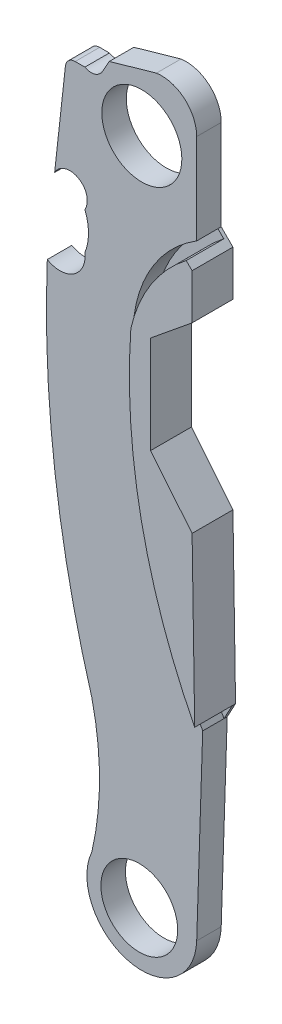
ISO-10303-21;
HEADER;
FILE_DESCRIPTION(('STEP AP214'),'2;1');
FILE_NAME('part.step','',(''),(''),'','','');
FILE_SCHEMA(('AUTOMOTIVE_DESIGN { 1 0 10303 214 1 1 1 1 }'));
ENDSEC;
DATA;
#1=APPLICATION_CONTEXT('core data for automotive mechanical design processes');
#2=APPLICATION_PROTOCOL_DEFINITION('international standard','automotive_design',2000,#1);
#3=PRODUCT_CONTEXT('',#1,'mechanical');
#4=PRODUCT('Part','Part','',(#3));
#5=PRODUCT_RELATED_PRODUCT_CATEGORY('part','',(#4));
#6=PRODUCT_DEFINITION_FORMATION('','',#4);
#7=PRODUCT_DEFINITION_CONTEXT('part definition',#1,'design');
#8=PRODUCT_DEFINITION('design','',#6,#7);
#9=PRODUCT_DEFINITION_SHAPE('','',#8);
#10=(LENGTH_UNIT() NAMED_UNIT(*) SI_UNIT(.MILLI.,.METRE.));
#11=(NAMED_UNIT(*) PLANE_ANGLE_UNIT() SI_UNIT($,.RADIAN.));
#12=(NAMED_UNIT(*) SI_UNIT($,.STERADIAN.) SOLID_ANGLE_UNIT());
#13=UNCERTAINTY_MEASURE_WITH_UNIT(LENGTH_MEASURE(1.E-05),#10,'distance_accuracy_value','');
#14=(GEOMETRIC_REPRESENTATION_CONTEXT(3) GLOBAL_UNCERTAINTY_ASSIGNED_CONTEXT((#13)) GLOBAL_UNIT_ASSIGNED_CONTEXT((#10,
#11,#12)) REPRESENTATION_CONTEXT('',''));
#15=CARTESIAN_POINT('',(0.,0.,0.));
#16=DIRECTION('',(0.,0.,1.));
#17=DIRECTION('',(1.,0.,0.));
#18=AXIS2_PLACEMENT_3D('',#15,#16,#17);
#19=CARTESIAN_POINT('',(50.0722762093475,53.7157787398981,1.905));
#20=DIRECTION('',(0.,0.,1.));
#21=DIRECTION('',(1.,0.,0.));
#22=AXIS2_PLACEMENT_3D('',#19,#20,#21);
#23=PLANE('',#22);
#24=DIRECTION('',(-1.,0.,0.));
#25=VECTOR('',#24,1.);
#26=CARTESIAN_POINT('',(52.0127922225497,66.4382932997612,1.905));
#27=LINE('',#26,#25);
#28=CARTESIAN_POINT('',(52.0127922225497,66.4382932997612,1.905));
#29=VERTEX_POINT('',#28);
#30=CARTESIAN_POINT('',(51.2572794481798,66.4382932997612,1.905));
#31=VERTEX_POINT('',#30);
#32=EDGE_CURVE('E348',#29,#31,#27,.T.);
#33=ORIENTED_EDGE('',*,*,#32,.T.);
#34=CARTESIAN_POINT('',(51.2572794481798,65.6762932997612,1.905));
#35=DIRECTION('',(0.,0.,1.));
#36=DIRECTION('',(1.,0.,0.));
#37=AXIS2_PLACEMENT_3D('',#34,#35,#36);
#38=CIRCLE('',#37,0.762);
#39=CARTESIAN_POINT('',(50.4998825776894,65.7599233217105,1.905));
#40=VERTEX_POINT('',#39);
#41=EDGE_CURVE('E11',#31,#40,#38,.T.);
#42=ORIENTED_EDGE('',*,*,#41,.T.);
#43=DIRECTION('',(-0.109750684972808,-0.993959147625293,0.));
#44=VECTOR('',#43,1.);
#45=CARTESIAN_POINT('',(50.5747866317784,66.4382932997612,1.905));
#46=LINE('',#45,#44);
#47=CARTESIAN_POINT('',(49.6617680186369,58.1695230163776,1.905));
#48=VERTEX_POINT('',#47);
#49=EDGE_CURVE('E351',#40,#48,#46,.T.);
#50=ORIENTED_EDGE('',*,*,#49,.T.);
#51=CARTESIAN_POINT('',(50.8510578915076,57.535910774816,1.905));
#52=DIRECTION('',(0.,0.,-1.));
#53=DIRECTION('',(-1.,0.,0.));
#54=AXIS2_PLACEMENT_3D('',#51,#52,#53);
#55=CIRCLE('',#54,1.34754401574473);
#56=CARTESIAN_POINT('',(52.0127922225497,56.8530870651751,1.905));
#57=VERTEX_POINT('',#56);
#58=EDGE_CURVE('E354',#48,#57,#55,.T.);
#59=ORIENTED_EDGE('',*,*,#58,.T.);
#60=CARTESIAN_POINT('',(48.401084811028,55.4010701954155,1.905));
#61=DIRECTION('',(0.,0.,-1.));
#62=DIRECTION('',(-1.,0.,0.));
#63=AXIS2_PLACEMENT_3D('',#60,#61,#62);
#64=CIRCLE('',#63,3.89265762898655);
#65=CARTESIAN_POINT('',(52.0127922225497,53.9490533256559,1.905));
#66=VERTEX_POINT('',#65);
#67=EDGE_CURVE('E357',#57,#66,#64,.T.);
#68=ORIENTED_EDGE('',*,*,#67,.T.);
#69=CARTESIAN_POINT('',(50.0722762093475,53.7157787398981,1.905));
#70=DIRECTION('',(0.,0.,-1.));
#71=DIRECTION('',(1.,0.,0.));
#72=AXIS2_PLACEMENT_3D('',#69,#70,#71);
#73=CIRCLE('',#72,1.95448699915211);
#74=CARTESIAN_POINT('',(49.0908895912101,52.0255421482946,1.905));
#75=VERTEX_POINT('',#74);
#76=EDGE_CURVE('E315',#66,#75,#73,.T.);
#77=ORIENTED_EDGE('',*,*,#76,.T.);
#78=CARTESIAN_POINT('',(135.006157785318,48.6454185749428,1.905));
#79=DIRECTION('',(0.,0.,1.));
#80=DIRECTION('',(1.,0.,0.));
#81=AXIS2_PLACEMENT_3D('',#78,#79,#80);
#82=CIRCLE('',#81,85.981733782453);
#83=CARTESIAN_POINT('',(52.5519853862674,24.269857079374,1.905));
#84=VERTEX_POINT('',#83);
#85=EDGE_CURVE('E319',#75,#84,#82,.T.);
#86=ORIENTED_EDGE('',*,*,#85,.T.);
#87=CARTESIAN_POINT('',(30.2386799556613,19.0683045117602,1.905));
#88=DIRECTION('',(0.,0.,-1.));
#89=DIRECTION('',(-1.,0.,0.));
#90=AXIS2_PLACEMENT_3D('',#87,#88,#89);
#91=CIRCLE('',#90,22.9115636383282);
#92=CARTESIAN_POINT('',(52.5519853862674,13.8667519441464,1.905));
#93=VERTEX_POINT('',#92);
#94=EDGE_CURVE('E323',#84,#93,#91,.T.);
#95=ORIENTED_EDGE('',*,*,#94,.T.);
#96=CARTESIAN_POINT('',(56.4387038114472,12.1024392773493,1.905));
#97=DIRECTION('',(0.,0.,1.));
#98=DIRECTION('',(1.,0.,0.));
#99=AXIS2_PLACEMENT_3D('',#96,#97,#98);
#100=CIRCLE('',#99,4.26841648657357);
#101=CARTESIAN_POINT('',(60.7049448561314,11.9661797767456,1.905));
#102=VERTEX_POINT('',#101);
#103=EDGE_CURVE('E326',#93,#102,#100,.T.);
#104=ORIENTED_EDGE('',*,*,#103,.T.);
#105=DIRECTION('',(0.03245153627747,0.999473310195541,0.));
#106=VECTOR('',#105,1.);
#107=CARTESIAN_POINT('',(61.1713906295038,26.332220791048,1.905));
#108=LINE('',#107,#106);
#109=CARTESIAN_POINT('',(61.1713906295038,26.332220791048,1.905));
#110=VERTEX_POINT('',#109);
#111=EDGE_CURVE('E329',#102,#110,#108,.T.);
#112=ORIENTED_EDGE('',*,*,#111,.T.);
#113=CARTESIAN_POINT('',(101.721992842628,48.0936151842676,1.905));
#114=DIRECTION('',(0.,0.,1.));
#115=DIRECTION('',(1.,0.,0.));
#116=AXIS2_PLACEMENT_3D('',#113,#114,#115);
#117=CIRCLE('',#116,46.0207521210194);
#118=CARTESIAN_POINT('',(55.8334864997148,51.5799616100679,1.905));
#119=VERTEX_POINT('',#118);
#120=EDGE_CURVE('E272',#119,#110,#117,.T.);
#121=ORIENTED_EDGE('',*,*,#120,.F.);
#122=CARTESIAN_POINT('',(66.1632396670353,50.2045246947159,1.905));
#123=DIRECTION('',(0.,0.,1.));
#124=DIRECTION('',(-1.,0.,0.));
#125=AXIS2_PLACEMENT_3D('',#122,#123,#124);
#126=CIRCLE('',#125,10.4209225698055);
#127=CARTESIAN_POINT('',(60.7049448561314,59.0816100814372,1.905));
#128=VERTEX_POINT('',#127);
#129=EDGE_CURVE('E268',#128,#119,#126,.T.);
#130=ORIENTED_EDGE('',*,*,#129,.F.);
#131=DIRECTION('',(0.,1.,0.));
#132=VECTOR('',#131,1.);
#133=CARTESIAN_POINT('',(60.7049448561314,59.0816100814372,1.905));
#134=LINE('',#133,#132);
#135=CARTESIAN_POINT('',(60.7049448561314,66.1080677104035,1.905));
#136=VERTEX_POINT('',#135);
#137=EDGE_CURVE('E333',#128,#136,#134,.T.);
#138=ORIENTED_EDGE('',*,*,#137,.T.);
#139=CARTESIAN_POINT('',(57.9709998620621,66.1080677104035,1.905));
#140=DIRECTION('',(0.,0.,1.));
#141=DIRECTION('',(1.,0.,0.));
#142=AXIS2_PLACEMENT_3D('',#139,#140,#141);
#143=CIRCLE('',#142,2.73394499406928);
#144=CARTESIAN_POINT('',(57.574604609756,68.8131233539247,1.905));
#145=VERTEX_POINT('',#144);
#146=EDGE_CURVE('E336',#136,#145,#143,.T.);
#147=ORIENTED_EDGE('',*,*,#146,.T.);
#148=DIRECTION('',(-0.961726431956205,-0.274011441507076,0.));
#149=VECTOR('',#148,1.);
#150=CARTESIAN_POINT('',(57.574604609756,68.8131233539247,1.905));
#151=LINE('',#150,#149);
#152=CARTESIAN_POINT('',(53.9094823041698,67.7688706299867,1.905));
#153=VERTEX_POINT('',#152);
#154=EDGE_CURVE('E339',#145,#153,#151,.T.);
#155=ORIENTED_EDGE('',*,*,#154,.T.);
#156=DIRECTION('',(-0.492057256667899,-0.870562838720136,0.));
#157=VECTOR('',#156,1.);
#158=CARTESIAN_POINT('',(53.9094823041698,67.7688706299867,1.905));
#159=LINE('',#158,#157);
#160=CARTESIAN_POINT('',(53.3738532334988,66.821219197261,1.905));
#161=VERTEX_POINT('',#160);
#162=EDGE_CURVE('E342',#153,#161,#159,.T.);
#163=ORIENTED_EDGE('',*,*,#162,.T.);
#164=CARTESIAN_POINT('',(52.5005890825524,67.3148032825786,1.905));
#165=DIRECTION('',(0.,0.,-1.));
#166=DIRECTION('',(-1.,0.,0.));
#167=AXIS2_PLACEMENT_3D('',#164,#165,#166);
#168=CIRCLE('',#167,1.00310294915672);
#169=EDGE_CURVE('E345',#161,#29,#168,.T.);
#170=ORIENTED_EDGE('',*,*,#169,.T.);
#171=EDGE_LOOP('',(#33,#42,#50,#59,#68,#77,#86,#95,#104,#112,#121,#130,#138,#147,#155,#163,#170));
#172=FACE_BOUND('',#171,.T.);
#173=CARTESIAN_POINT('',(56.4387038114472,64.0207733938482,1.905));
#174=DIRECTION('',(0.,0.,1.));
#175=DIRECTION('',(1.,0.,0.));
#176=AXIS2_PLACEMENT_3D('',#173,#174,#175);
#177=CIRCLE('',#176,3.1115);
#178=CARTESIAN_POINT('',(59.5502038114472,64.0207733938482,1.905));
#179=VERTEX_POINT('',#178);
#180=EDGE_CURVE('E307',#179,#179,#177,.T.);
#181=ORIENTED_EDGE('',*,*,#180,.F.);
#182=EDGE_LOOP('',(#181));
#183=FACE_BOUND('',#182,.T.);
#184=CARTESIAN_POINT('',(56.2419517044102,11.9571546198664,1.905));
#185=DIRECTION('',(0.,0.,1.));
#186=DIRECTION('',(1.,0.,0.));
#187=AXIS2_PLACEMENT_3D('',#184,#185,#186);
#188=CIRCLE('',#187,2.9845);
#189=CARTESIAN_POINT('',(59.2264517044102,11.9571546198664,1.905));
#190=VERTEX_POINT('',#189);
#191=EDGE_CURVE('E299',#190,#190,#188,.T.);
#192=ORIENTED_EDGE('',*,*,#191,.F.);
#193=EDGE_LOOP('',(#192));
#194=FACE_BOUND('',#193,.T.);
#195=ADVANCED_FACE('F39',(#172,#183,#194),#23,.T.);
#196=CARTESIAN_POINT('',(50.0722762093475,53.7157787398981,0.));
#197=DIRECTION('',(0.,0.,1.));
#198=DIRECTION('',(1.,0.,0.));
#199=AXIS2_PLACEMENT_3D('',#196,#197,#198);
#200=PLANE('',#199);
#201=DIRECTION('',(-0.109750684972808,-0.993959147625293,0.));
#202=VECTOR('',#201,1.);
#203=CARTESIAN_POINT('',(50.5747866317784,66.4382932997612,0.));
#204=LINE('',#203,#202);
#205=CARTESIAN_POINT('',(50.4998825776894,65.7599233217105,0.));
#206=VERTEX_POINT('',#205);
#207=CARTESIAN_POINT('',(49.6617680186369,58.1695230163776,0.));
#208=VERTEX_POINT('',#207);
#209=EDGE_CURVE('E418',#206,#208,#204,.T.);
#210=ORIENTED_EDGE('',*,*,#209,.F.);
#211=CARTESIAN_POINT('',(51.2572794481798,65.6762932997612,0.));
#212=DIRECTION('',(0.,0.,1.));
#213=DIRECTION('',(1.,0.,0.));
#214=AXIS2_PLACEMENT_3D('',#211,#212,#213);
#215=CIRCLE('',#214,0.762);
#216=CARTESIAN_POINT('',(51.2572794481798,66.4382932997612,0.));
#217=VERTEX_POINT('',#216);
#218=EDGE_CURVE('E62',#206,#217,#215,.F.);
#219=ORIENTED_EDGE('',*,*,#218,.T.);
#220=DIRECTION('',(-1.,0.,0.));
#221=VECTOR('',#220,1.);
#222=CARTESIAN_POINT('',(52.0127922225497,66.4382932997612,0.));
#223=LINE('',#222,#221);
#224=CARTESIAN_POINT('',(52.0127922225497,66.4382932997612,0.));
#225=VERTEX_POINT('',#224);
#226=EDGE_CURVE('E415',#225,#217,#223,.T.);
#227=ORIENTED_EDGE('',*,*,#226,.F.);
#228=CARTESIAN_POINT('',(52.5005890825524,67.3148032825786,0.));
#229=DIRECTION('',(0.,0.,-1.));
#230=DIRECTION('',(-1.,0.,0.));
#231=AXIS2_PLACEMENT_3D('',#228,#229,#230);
#232=CIRCLE('',#231,1.00310294915672);
#233=CARTESIAN_POINT('',(53.3738532334988,66.821219197261,0.));
#234=VERTEX_POINT('',#233);
#235=EDGE_CURVE('E412',#234,#225,#232,.T.);
#236=ORIENTED_EDGE('',*,*,#235,.F.);
#237=DIRECTION('',(-0.492057256667899,-0.870562838720136,0.));
#238=VECTOR('',#237,1.);
#239=CARTESIAN_POINT('',(53.9094823041698,67.7688706299867,0.));
#240=LINE('',#239,#238);
#241=CARTESIAN_POINT('',(53.9094823041698,67.7688706299867,0.));
#242=VERTEX_POINT('',#241);
#243=EDGE_CURVE('E409',#242,#234,#240,.T.);
#244=ORIENTED_EDGE('',*,*,#243,.F.);
#245=DIRECTION('',(-0.961726431956205,-0.274011441507076,0.));
#246=VECTOR('',#245,1.);
#247=CARTESIAN_POINT('',(57.574604609756,68.8131233539247,0.));
#248=LINE('',#247,#246);
#249=CARTESIAN_POINT('',(57.574604609756,68.8131233539247,0.));
#250=VERTEX_POINT('',#249);
#251=EDGE_CURVE('E406',#250,#242,#248,.T.);
#252=ORIENTED_EDGE('',*,*,#251,.F.);
#253=CARTESIAN_POINT('',(57.9709998620621,66.1080677104035,0.));
#254=DIRECTION('',(0.,0.,1.));
#255=DIRECTION('',(1.,0.,0.));
#256=AXIS2_PLACEMENT_3D('',#253,#254,#255);
#257=CIRCLE('',#256,2.73394499406928);
#258=CARTESIAN_POINT('',(60.7049448561314,66.1080677104035,0.));
#259=VERTEX_POINT('',#258);
#260=EDGE_CURVE('E403',#259,#250,#257,.T.);
#261=ORIENTED_EDGE('',*,*,#260,.F.);
#262=DIRECTION('',(0.,1.,0.));
#263=VECTOR('',#262,1.);
#264=CARTESIAN_POINT('',(60.7049448561314,59.0816100814372,0.));
#265=LINE('',#264,#263);
#266=CARTESIAN_POINT('',(60.7049448561314,59.0816100814372,0.));
#267=VERTEX_POINT('',#266);
#268=EDGE_CURVE('E400',#267,#259,#265,.T.);
#269=ORIENTED_EDGE('',*,*,#268,.F.);
#270=DIRECTION('',(-0.707106781186553,0.707106781186542,0.));
#271=VECTOR('',#270,1.);
#272=CARTESIAN_POINT('',(61.617031921191,58.1695230163776,0.));
#273=LINE('',#272,#271);
#274=CARTESIAN_POINT('',(61.617031921191,58.1695230163776,0.));
#275=VERTEX_POINT('',#274);
#276=EDGE_CURVE('E396',#275,#267,#273,.T.);
#277=ORIENTED_EDGE('',*,*,#276,.F.);
#278=DIRECTION('',(0.,1.,0.));
#279=VECTOR('',#278,1.);
#280=CARTESIAN_POINT('',(61.617031921191,58.1695230163776,0.));
#281=LINE('',#280,#279);
#282=CARTESIAN_POINT('',(61.617031921191,54.6559978970601,0.));
#283=VERTEX_POINT('',#282);
#284=EDGE_CURVE('E393',#283,#275,#281,.T.);
#285=ORIENTED_EDGE('',*,*,#284,.F.);
#286=DIRECTION('',(0.775111246885178,0.63182478184391,0.));
#287=VECTOR('',#286,1.);
#288=CARTESIAN_POINT('',(58.390036251044,52.0255421482946,0.));
#289=LINE('',#288,#287);
#290=CARTESIAN_POINT('',(58.390036251044,52.0255421482946,0.));
#291=VERTEX_POINT('',#290);
#292=EDGE_CURVE('E390',#291,#283,#289,.T.);
#293=ORIENTED_EDGE('',*,*,#292,.F.);
#294=DIRECTION('',(0.,1.,0.));
#295=VECTOR('',#294,1.);
#296=CARTESIAN_POINT('',(58.390036251044,44.4455728530953,0.));
#297=LINE('',#296,#295);
#298=CARTESIAN_POINT('',(58.390036251044,44.4455728530953,0.));
#299=VERTEX_POINT('',#298);
#300=EDGE_CURVE('E387',#299,#291,#297,.T.);
#301=ORIENTED_EDGE('',*,*,#300,.F.);
#302=DIRECTION('',(-0.63182478184391,0.775111246885178,0.));
#303=VECTOR('',#302,1.);
#304=CARTESIAN_POINT('',(61.617031921191,40.4867527664868,0.));
#305=LINE('',#304,#303);
#306=CARTESIAN_POINT('',(61.617031921191,40.4867527664868,0.));
#307=VERTEX_POINT('',#306);
#308=EDGE_CURVE('E384',#307,#299,#305,.T.);
#309=ORIENTED_EDGE('',*,*,#308,.F.);
#310=DIRECTION('',(-0.0156069453419689,0.999878204211439,0.));
#311=VECTOR('',#310,1.);
#312=CARTESIAN_POINT('',(61.8192206741317,27.5332809132568,0.));
#313=LINE('',#312,#311);
#314=CARTESIAN_POINT('',(61.8192206741317,27.5332809132568,0.));
#315=VERTEX_POINT('',#314);
#316=EDGE_CURVE('E381',#315,#307,#313,.T.);
#317=ORIENTED_EDGE('',*,*,#316,.F.);
#318=DIRECTION('',(0.474727643321267,0.880132754001711,0.));
#319=VECTOR('',#318,1.);
#320=CARTESIAN_POINT('',(61.1713906295038,26.332220791048,0.));
#321=LINE('',#320,#319);
#322=CARTESIAN_POINT('',(61.1713906295038,26.332220791048,0.));
#323=VERTEX_POINT('',#322);
#324=EDGE_CURVE('E377',#323,#315,#321,.T.);
#325=ORIENTED_EDGE('',*,*,#324,.F.);
#326=DIRECTION('',(0.03245153627747,0.999473310195541,0.));
#327=VECTOR('',#326,1.);
#328=CARTESIAN_POINT('',(61.1713906295038,26.332220791048,0.));
#329=LINE('',#328,#327);
#330=CARTESIAN_POINT('',(60.7049448561314,11.9661797767456,0.));
#331=VERTEX_POINT('',#330);
#332=EDGE_CURVE('E373',#331,#323,#329,.T.);
#333=ORIENTED_EDGE('',*,*,#332,.F.);
#334=CARTESIAN_POINT('',(56.4387038114472,12.1024392773493,0.));
#335=DIRECTION('',(0.,0.,1.));
#336=DIRECTION('',(1.,0.,0.));
#337=AXIS2_PLACEMENT_3D('',#334,#335,#336);
#338=CIRCLE('',#337,4.26841648657357);
#339=CARTESIAN_POINT('',(52.5519853862674,13.8667519441464,0.));
#340=VERTEX_POINT('',#339);
#341=EDGE_CURVE('E370',#340,#331,#338,.T.);
#342=ORIENTED_EDGE('',*,*,#341,.F.);
#343=CARTESIAN_POINT('',(30.2386799556613,19.0683045117602,0.));
#344=DIRECTION('',(0.,0.,-1.));
#345=DIRECTION('',(-1.,0.,0.));
#346=AXIS2_PLACEMENT_3D('',#343,#344,#345);
#347=CIRCLE('',#346,22.9115636383282);
#348=CARTESIAN_POINT('',(52.5519853862674,24.269857079374,0.));
#349=VERTEX_POINT('',#348);
#350=EDGE_CURVE('E367',#349,#340,#347,.T.);
#351=ORIENTED_EDGE('',*,*,#350,.F.);
#352=CARTESIAN_POINT('',(135.006157785318,48.6454185749428,0.));
#353=DIRECTION('',(0.,0.,1.));
#354=DIRECTION('',(1.,0.,0.));
#355=AXIS2_PLACEMENT_3D('',#352,#353,#354);
#356=CIRCLE('',#355,85.981733782453);
#357=CARTESIAN_POINT('',(49.0908895912101,52.0255421482946,0.));
#358=VERTEX_POINT('',#357);
#359=EDGE_CURVE('E364',#358,#349,#356,.T.);
#360=ORIENTED_EDGE('',*,*,#359,.F.);
#361=CARTESIAN_POINT('',(50.0722762093475,53.7157787398981,0.));
#362=DIRECTION('',(0.,0.,-1.));
#363=DIRECTION('',(1.,0.,0.));
#364=AXIS2_PLACEMENT_3D('',#361,#362,#363);
#365=CIRCLE('',#364,1.95448699915211);
#366=CARTESIAN_POINT('',(52.0127922225497,53.9490533256559,0.));
#367=VERTEX_POINT('',#366);
#368=EDGE_CURVE('E311',#367,#358,#365,.T.);
#369=ORIENTED_EDGE('',*,*,#368,.F.);
#370=CARTESIAN_POINT('',(48.401084811028,55.4010701954155,0.));
#371=DIRECTION('',(0.,0.,-1.));
#372=DIRECTION('',(-1.,0.,0.));
#373=AXIS2_PLACEMENT_3D('',#370,#371,#372);
#374=CIRCLE('',#373,3.89265762898655);
#375=CARTESIAN_POINT('',(52.0127922225497,56.8530870651751,0.));
#376=VERTEX_POINT('',#375);
#377=EDGE_CURVE('E320',#376,#367,#374,.T.);
#378=ORIENTED_EDGE('',*,*,#377,.F.);
#379=CARTESIAN_POINT('',(50.8510578915076,57.535910774816,0.));
#380=DIRECTION('',(0.,0.,-1.));
#381=DIRECTION('',(-1.,0.,0.));
#382=AXIS2_PLACEMENT_3D('',#379,#380,#381);
#383=CIRCLE('',#382,1.34754401574473);
#384=EDGE_CURVE('E421',#208,#376,#383,.T.);
#385=ORIENTED_EDGE('',*,*,#384,.F.);
#386=EDGE_LOOP('',(#210,#219,#227,#236,#244,#252,#261,#269,#277,#285,#293,#301,#309,#317,#325,
#333,#342,#351,#360,#369,#378,#385));
#387=FACE_BOUND('',#386,.T.);
#388=CARTESIAN_POINT('',(56.4387038114472,64.0207733938482,0.));
#389=DIRECTION('',(0.,0.,1.));
#390=DIRECTION('',(1.,0.,0.));
#391=AXIS2_PLACEMENT_3D('',#388,#389,#390);
#392=CIRCLE('',#391,3.1115);
#393=CARTESIAN_POINT('',(59.5502038114472,64.0207733938482,0.));
#394=VERTEX_POINT('',#393);
#395=EDGE_CURVE('E303',#394,#394,#392,.T.);
#396=ORIENTED_EDGE('',*,*,#395,.T.);
#397=EDGE_LOOP('',(#396));
#398=FACE_BOUND('',#397,.T.);
#399=CARTESIAN_POINT('',(56.2419517044102,11.9571546198664,0.));
#400=DIRECTION('',(0.,0.,1.));
#401=DIRECTION('',(1.,0.,0.));
#402=AXIS2_PLACEMENT_3D('',#399,#400,#401);
#403=CIRCLE('',#402,2.9845);
#404=CARTESIAN_POINT('',(59.2264517044102,11.9571546198664,0.));
#405=VERTEX_POINT('',#404);
#406=EDGE_CURVE('E227',#405,#405,#403,.T.);
#407=ORIENTED_EDGE('',*,*,#406,.T.);
#408=EDGE_LOOP('',(#407));
#409=FACE_BOUND('',#408,.T.);
#410=ADVANCED_FACE('F526',(#387,#398,#409),#200,.F.);
#411=CARTESIAN_POINT('',(50.0722762093475,53.7157787398981,1.905));
#412=DIRECTION('',(0.,0.,-1.));
#413=DIRECTION('',(-1.,0.,0.));
#414=AXIS2_PLACEMENT_3D('',#411,#412,#413);
#415=CYLINDRICAL_SURFACE('',#414,1.95448699915211);
#416=ORIENTED_EDGE('',*,*,#368,.T.);
#417=DIRECTION('',(0.,0.,-1.));
#418=VECTOR('',#417,1.);
#419=CARTESIAN_POINT('',(49.0908895912101,52.0255421482946,1.905));
#420=LINE('',#419,#418);
#421=EDGE_CURVE('E501',#75,#358,#420,.T.);
#422=ORIENTED_EDGE('',*,*,#421,.F.);
#423=ORIENTED_EDGE('',*,*,#76,.F.);
#424=DIRECTION('',(0.,0.,-1.));
#425=VECTOR('',#424,1.);
#426=CARTESIAN_POINT('',(52.0127922225497,53.9490533256559,1.905));
#427=LINE('',#426,#425);
#428=EDGE_CURVE('E360',#66,#367,#427,.T.);
#429=ORIENTED_EDGE('',*,*,#428,.T.);
#430=EDGE_LOOP('',(#416,#422,#423,#429));
#431=FACE_BOUND('',#430,.T.);
#432=ADVANCED_FACE('F587',(#431),#415,.F.);
#433=CARTESIAN_POINT('',(135.006157785318,48.6454185749428,1.905));
#434=DIRECTION('',(0.,0.,-1.));
#435=DIRECTION('',(-1.,0.,0.));
#436=AXIS2_PLACEMENT_3D('',#433,#434,#435);
#437=CYLINDRICAL_SURFACE('',#436,85.981733782453);
#438=ORIENTED_EDGE('',*,*,#359,.T.);
#439=DIRECTION('',(0.,0.,-1.));
#440=VECTOR('',#439,1.);
#441=CARTESIAN_POINT('',(52.5519853862674,24.269857079374,1.905));
#442=LINE('',#441,#440);
#443=EDGE_CURVE('E497',#84,#349,#442,.T.);
#444=ORIENTED_EDGE('',*,*,#443,.F.);
#445=ORIENTED_EDGE('',*,*,#85,.F.);
#446=ORIENTED_EDGE('',*,*,#421,.T.);
#447=EDGE_LOOP('',(#438,#444,#445,#446));
#448=FACE_BOUND('',#447,.T.);
#449=ADVANCED_FACE('F820',(#448),#437,.T.);
#450=CARTESIAN_POINT('',(30.2386799556613,19.0683045117602,1.905));
#451=DIRECTION('',(0.,0.,-1.));
#452=DIRECTION('',(-1.,0.,0.));
#453=AXIS2_PLACEMENT_3D('',#450,#451,#452);
#454=CYLINDRICAL_SURFACE('',#453,22.9115636383282);
#455=ORIENTED_EDGE('',*,*,#350,.T.);
#456=DIRECTION('',(0.,0.,-1.));
#457=VECTOR('',#456,1.);
#458=CARTESIAN_POINT('',(52.5519853862674,13.8667519441464,1.905));
#459=LINE('',#458,#457);
#460=EDGE_CURVE('E493',#93,#340,#459,.T.);
#461=ORIENTED_EDGE('',*,*,#460,.F.);
#462=ORIENTED_EDGE('',*,*,#94,.F.);
#463=ORIENTED_EDGE('',*,*,#443,.T.);
#464=EDGE_LOOP('',(#455,#461,#462,#463));
#465=FACE_BOUND('',#464,.T.);
#466=ADVANCED_FACE('F812',(#465),#454,.F.);
#467=CARTESIAN_POINT('',(56.4387038114472,12.1024392773493,1.905));
#468=DIRECTION('',(0.,0.,-1.));
#469=DIRECTION('',(-1.,0.,0.));
#470=AXIS2_PLACEMENT_3D('',#467,#468,#469);
#471=CYLINDRICAL_SURFACE('',#470,4.26841648657357);
#472=ORIENTED_EDGE('',*,*,#341,.T.);
#473=DIRECTION('',(0.,0.,-1.));
#474=VECTOR('',#473,1.);
#475=CARTESIAN_POINT('',(60.7049448561314,11.9661797767456,1.905));
#476=LINE('',#475,#474);
#477=EDGE_CURVE('E489',#102,#331,#476,.T.);
#478=ORIENTED_EDGE('',*,*,#477,.F.);
#479=ORIENTED_EDGE('',*,*,#103,.F.);
#480=ORIENTED_EDGE('',*,*,#460,.T.);
#481=EDGE_LOOP('',(#472,#478,#479,#480));
#482=FACE_BOUND('',#481,.T.);
#483=ADVANCED_FACE('F805',(#482),#471,.T.);
#484=CARTESIAN_POINT('',(61.1713906295038,26.332220791048,1.905));
#485=DIRECTION('',(-0.999473310195541,0.03245153627747,0.));
#486=DIRECTION('',(-0.03245153627747,-0.999473310195541,0.));
#487=AXIS2_PLACEMENT_3D('',#484,#485,#486);
#488=PLANE('',#487);
#489=ORIENTED_EDGE('',*,*,#332,.T.);
#490=DIRECTION('',(0.,0.,-1.));
#491=VECTOR('',#490,1.);
#492=CARTESIAN_POINT('',(61.1713906295038,26.332220791048,1.905));
#493=LINE('',#492,#491);
#494=CARTESIAN_POINT('',(61.1713906295038,26.332220791048,0.254));
#495=VERTEX_POINT('',#494);
#496=EDGE_CURVE('E485',#495,#323,#493,.T.);
#497=ORIENTED_EDGE('',*,*,#496,.F.);
#498=EDGE_CURVE('E486',#110,#495,#493,.T.);
#499=ORIENTED_EDGE('',*,*,#498,.F.);
#500=ORIENTED_EDGE('',*,*,#111,.F.);
#501=ORIENTED_EDGE('',*,*,#477,.T.);
#502=EDGE_LOOP('',(#489,#497,#499,#500,#501));
#503=FACE_BOUND('',#502,.T.);
#504=ADVANCED_FACE('F800',(#503),#488,.F.);
#505=CARTESIAN_POINT('',(61.1713906295038,26.332220791048,1.905));
#506=DIRECTION('',(-0.880132754001711,0.474727643321267,0.));
#507=DIRECTION('',(-0.474727643321267,-0.880132754001711,0.));
#508=AXIS2_PLACEMENT_3D('',#505,#506,#507);
#509=PLANE('',#508);
#510=DIRECTION('',(0.,0.,-1.));
#511=VECTOR('',#510,1.);
#512=CARTESIAN_POINT('',(61.8192206741317,27.5332809132568,1.905));
#513=LINE('',#512,#511);
#514=CARTESIAN_POINT('',(61.8192206741317,27.5332809132568,0.254));
#515=VERTEX_POINT('',#514);
#516=EDGE_CURVE('E482',#515,#315,#513,.T.);
#517=ORIENTED_EDGE('',*,*,#516,.F.);
#518=DIRECTION('',(0.474727643321267,0.880132754001711,0.));
#519=VECTOR('',#518,1.);
#520=CARTESIAN_POINT('',(61.8192206741317,27.5332809132568,0.254));
#521=LINE('',#520,#519);
#522=EDGE_CURVE('E283',#495,#515,#521,.T.);
#523=ORIENTED_EDGE('',*,*,#522,.F.);
#524=ORIENTED_EDGE('',*,*,#496,.T.);
#525=ORIENTED_EDGE('',*,*,#324,.T.);
#526=EDGE_LOOP('',(#517,#523,#524,#525));
#527=FACE_BOUND('',#526,.T.);
#528=ADVANCED_FACE('F553',(#527),#509,.F.);
#529=CARTESIAN_POINT('',(61.8192206741317,27.5332809132568,1.905));
#530=DIRECTION('',(-0.999878204211439,-0.0156069453419689,0.));
#531=DIRECTION('',(0.0156069453419689,-0.999878204211439,0.));
#532=AXIS2_PLACEMENT_3D('',#529,#530,#531);
#533=PLANE('',#532);
#534=ORIENTED_EDGE('',*,*,#316,.T.);
#535=DIRECTION('',(0.,0.,-1.));
#536=VECTOR('',#535,1.);
#537=CARTESIAN_POINT('',(61.617031921191,40.4867527664868,1.905));
#538=LINE('',#537,#536);
#539=CARTESIAN_POINT('',(61.617031921191,40.4867527664868,3.175));
#540=VERTEX_POINT('',#539);
#541=EDGE_CURVE('E478',#540,#307,#538,.T.);
#542=ORIENTED_EDGE('',*,*,#541,.F.);
#543=DIRECTION('',(-0.0156069453419689,0.999878204211439,0.));
#544=VECTOR('',#543,1.);
#545=CARTESIAN_POINT('',(61.8192206741317,27.5332809132568,3.175));
#546=LINE('',#545,#544);
#547=CARTESIAN_POINT('',(61.8192206741317,27.5332809132568,3.175));
#548=VERTEX_POINT('',#547);
#549=EDGE_CURVE('E239',#548,#540,#546,.T.);
#550=ORIENTED_EDGE('',*,*,#549,.F.);
#551=EDGE_CURVE('E234',#548,#515,#513,.T.);
#552=ORIENTED_EDGE('',*,*,#551,.T.);
#553=ORIENTED_EDGE('',*,*,#516,.T.);
#554=EDGE_LOOP('',(#534,#542,#550,#552,#553));
#555=FACE_BOUND('',#554,.T.);
#556=ADVANCED_FACE('F558',(#555),#533,.F.);
#557=CARTESIAN_POINT('',(61.617031921191,40.4867527664868,1.905));
#558=DIRECTION('',(-0.775111246885178,-0.63182478184391,0.));
#559=DIRECTION('',(0.63182478184391,-0.775111246885178,0.));
#560=AXIS2_PLACEMENT_3D('',#557,#558,#559);
#561=PLANE('',#560);
#562=ORIENTED_EDGE('',*,*,#308,.T.);
#563=DIRECTION('',(0.,0.,-1.));
#564=VECTOR('',#563,1.);
#565=CARTESIAN_POINT('',(58.390036251044,44.4455728530953,1.905));
#566=LINE('',#565,#564);
#567=CARTESIAN_POINT('',(58.390036251044,44.4455728530953,3.175));
#568=VERTEX_POINT('',#567);
#569=EDGE_CURVE('E474',#568,#299,#566,.T.);
#570=ORIENTED_EDGE('',*,*,#569,.F.);
#571=DIRECTION('',(-0.63182478184391,0.775111246885178,0.));
#572=VECTOR('',#571,1.);
#573=CARTESIAN_POINT('',(61.617031921191,40.4867527664868,3.175));
#574=LINE('',#573,#572);
#575=EDGE_CURVE('E251',#540,#568,#574,.T.);
#576=ORIENTED_EDGE('',*,*,#575,.F.);
#577=ORIENTED_EDGE('',*,*,#541,.T.);
#578=EDGE_LOOP('',(#562,#570,#576,#577));
#579=FACE_BOUND('',#578,.T.);
#580=ADVANCED_FACE('F562',(#579),#561,.F.);
#581=CARTESIAN_POINT('',(58.390036251044,44.4455728530953,1.905));
#582=DIRECTION('',(-1.,0.,0.));
#583=DIRECTION('',(0.,0.,1.));
#584=AXIS2_PLACEMENT_3D('',#581,#582,#583);
#585=PLANE('',#584);
#586=ORIENTED_EDGE('',*,*,#300,.T.);
#587=DIRECTION('',(0.,0.,-1.));
#588=VECTOR('',#587,1.);
#589=CARTESIAN_POINT('',(58.390036251044,52.0255421482946,1.905));
#590=LINE('',#589,#588);
#591=CARTESIAN_POINT('',(58.390036251044,52.0255421482946,3.175));
#592=VERTEX_POINT('',#591);
#593=EDGE_CURVE('E470',#592,#291,#590,.T.);
#594=ORIENTED_EDGE('',*,*,#593,.F.);
#595=DIRECTION('',(0.,1.,0.));
#596=VECTOR('',#595,1.);
#597=CARTESIAN_POINT('',(58.390036251044,44.4455728530953,3.175));
#598=LINE('',#597,#596);
#599=EDGE_CURVE('E255',#568,#592,#598,.T.);
#600=ORIENTED_EDGE('',*,*,#599,.F.);
#601=ORIENTED_EDGE('',*,*,#569,.T.);
#602=EDGE_LOOP('',(#586,#594,#600,#601));
#603=FACE_BOUND('',#602,.T.);
#604=ADVANCED_FACE('F566',(#603),#585,.F.);
#605=CARTESIAN_POINT('',(58.390036251044,52.0255421482946,1.905));
#606=DIRECTION('',(-0.63182478184391,0.775111246885178,0.));
#607=DIRECTION('',(-0.775111246885178,-0.63182478184391,0.));
#608=AXIS2_PLACEMENT_3D('',#605,#606,#607);
#609=PLANE('',#608);
#610=ORIENTED_EDGE('',*,*,#292,.T.);
#611=DIRECTION('',(0.,0.,-1.));
#612=VECTOR('',#611,1.);
#613=CARTESIAN_POINT('',(61.617031921191,54.6559978970601,1.905));
#614=LINE('',#613,#612);
#615=CARTESIAN_POINT('',(61.617031921191,54.6559978970601,3.175));
#616=VERTEX_POINT('',#615);
#617=EDGE_CURVE('E466',#616,#283,#614,.T.);
#618=ORIENTED_EDGE('',*,*,#617,.F.);
#619=DIRECTION('',(0.775111246885178,0.63182478184391,0.));
#620=VECTOR('',#619,1.);
#621=CARTESIAN_POINT('',(58.390036251044,52.0255421482946,3.175));
#622=LINE('',#621,#620);
#623=EDGE_CURVE('E259',#592,#616,#622,.T.);
#624=ORIENTED_EDGE('',*,*,#623,.F.);
#625=ORIENTED_EDGE('',*,*,#593,.T.);
#626=EDGE_LOOP('',(#610,#618,#624,#625));
#627=FACE_BOUND('',#626,.T.);
#628=ADVANCED_FACE('F569',(#627),#609,.F.);
#629=CARTESIAN_POINT('',(61.617031921191,58.1695230163776,1.905));
#630=DIRECTION('',(-1.,0.,0.));
#631=DIRECTION('',(0.,0.,1.));
#632=AXIS2_PLACEMENT_3D('',#629,#630,#631);
#633=PLANE('',#632);
#634=ORIENTED_EDGE('',*,*,#284,.T.);
#635=DIRECTION('',(0.,0.,-1.));
#636=VECTOR('',#635,1.);
#637=CARTESIAN_POINT('',(61.617031921191,58.1695230163776,1.905));
#638=LINE('',#637,#636);
#639=CARTESIAN_POINT('',(61.617031921191,58.1695230163776,3.175));
#640=VERTEX_POINT('',#639);
#641=EDGE_CURVE('E462',#640,#275,#638,.T.);
#642=ORIENTED_EDGE('',*,*,#641,.F.);
#643=DIRECTION('',(0.,1.,0.));
#644=VECTOR('',#643,1.);
#645=CARTESIAN_POINT('',(61.617031921191,54.6559978970601,3.175));
#646=LINE('',#645,#644);
#647=EDGE_CURVE('E263',#616,#640,#646,.T.);
#648=ORIENTED_EDGE('',*,*,#647,.F.);
#649=ORIENTED_EDGE('',*,*,#617,.T.);
#650=EDGE_LOOP('',(#634,#642,#648,#649));
#651=FACE_BOUND('',#650,.T.);
#652=ADVANCED_FACE('F573',(#651),#633,.F.);
#653=CARTESIAN_POINT('',(61.617031921191,58.1695230163776,1.905));
#654=DIRECTION('',(-0.707106781186542,-0.707106781186553,0.));
#655=DIRECTION('',(0.707106781186553,-0.707106781186542,0.));
#656=AXIS2_PLACEMENT_3D('',#653,#654,#655);
#657=PLANE('',#656);
#658=DIRECTION('',(-0.707106781186553,0.707106781186542,0.));
#659=VECTOR('',#658,1.);
#660=CARTESIAN_POINT('',(60.7049448561314,59.0816100814372,0.254));
#661=LINE('',#660,#659);
#662=CARTESIAN_POINT('',(61.1609883886612,58.6255665489074,0.254));
#663=VERTEX_POINT('',#662);
#664=CARTESIAN_POINT('',(60.7049448561314,59.0816100814372,0.254));
#665=VERTEX_POINT('',#664);
#666=EDGE_CURVE('E271',#663,#665,#661,.T.);
#667=ORIENTED_EDGE('',*,*,#666,.F.);
#668=DIRECTION('',(0.,0.,1.));
#669=VECTOR('',#668,1.);
#670=CARTESIAN_POINT('',(61.1609883886612,58.6255665489074,0.254));
#671=LINE('',#670,#669);
#672=CARTESIAN_POINT('',(61.1609883886612,58.6255665489074,3.175));
#673=VERTEX_POINT('',#672);
#674=EDGE_CURVE('E289',#663,#673,#671,.T.);
#675=ORIENTED_EDGE('',*,*,#674,.T.);
#676=DIRECTION('',(-0.707106781186553,0.707106781186542,0.));
#677=VECTOR('',#676,1.);
#678=CARTESIAN_POINT('',(61.617031921191,58.1695230163776,3.175));
#679=LINE('',#678,#677);
#680=EDGE_CURVE('E245',#640,#673,#679,.T.);
#681=ORIENTED_EDGE('',*,*,#680,.F.);
#682=ORIENTED_EDGE('',*,*,#641,.T.);
#683=ORIENTED_EDGE('',*,*,#276,.T.);
#684=DIRECTION('',(0.,0.,-1.));
#685=VECTOR('',#684,1.);
#686=CARTESIAN_POINT('',(60.7049448561314,59.0816100814372,1.905));
#687=LINE('',#686,#685);
#688=EDGE_CURVE('E457',#665,#267,#687,.T.);
#689=ORIENTED_EDGE('',*,*,#688,.F.);
#690=EDGE_LOOP('',(#667,#675,#681,#682,#683,#689));
#691=FACE_BOUND('',#690,.T.);
#692=ADVANCED_FACE('F523',(#691),#657,.F.);
#693=CARTESIAN_POINT('',(60.7049448561314,59.0816100814372,1.905));
#694=DIRECTION('',(-1.,0.,0.));
#695=DIRECTION('',(0.,0.,1.));
#696=AXIS2_PLACEMENT_3D('',#693,#694,#695);
#697=PLANE('',#696);
#698=ORIENTED_EDGE('',*,*,#268,.T.);
#699=DIRECTION('',(0.,0.,-1.));
#700=VECTOR('',#699,1.);
#701=CARTESIAN_POINT('',(60.7049448561314,66.1080677104035,1.905));
#702=LINE('',#701,#700);
#703=EDGE_CURVE('E453',#136,#259,#702,.T.);
#704=ORIENTED_EDGE('',*,*,#703,.F.);
#705=ORIENTED_EDGE('',*,*,#137,.F.);
#706=EDGE_CURVE('E458',#128,#665,#687,.T.);
#707=ORIENTED_EDGE('',*,*,#706,.T.);
#708=ORIENTED_EDGE('',*,*,#688,.T.);
#709=EDGE_LOOP('',(#698,#704,#705,#707,#708));
#710=FACE_BOUND('',#709,.T.);
#711=ADVANCED_FACE('F516',(#710),#697,.F.);
#712=CARTESIAN_POINT('',(57.9709998620621,66.1080677104035,1.905));
#713=DIRECTION('',(0.,0.,-1.));
#714=DIRECTION('',(-1.,0.,0.));
#715=AXIS2_PLACEMENT_3D('',#712,#713,#714);
#716=CYLINDRICAL_SURFACE('',#715,2.73394499406928);
#717=ORIENTED_EDGE('',*,*,#260,.T.);
#718=DIRECTION('',(0.,0.,-1.));
#719=VECTOR('',#718,1.);
#720=CARTESIAN_POINT('',(57.574604609756,68.8131233539247,1.905));
#721=LINE('',#720,#719);
#722=EDGE_CURVE('E449',#145,#250,#721,.T.);
#723=ORIENTED_EDGE('',*,*,#722,.F.);
#724=ORIENTED_EDGE('',*,*,#146,.F.);
#725=ORIENTED_EDGE('',*,*,#703,.T.);
#726=EDGE_LOOP('',(#717,#723,#724,#725));
#727=FACE_BOUND('',#726,.T.);
#728=ADVANCED_FACE('F532',(#727),#716,.T.);
#729=CARTESIAN_POINT('',(57.574604609756,68.8131233539247,1.905));
#730=DIRECTION('',(0.274011441507077,-0.961726431956206,0.));
#731=DIRECTION('',(0.961726431956206,0.274011441507077,0.));
#732=AXIS2_PLACEMENT_3D('',#729,#730,#731);
#733=PLANE('',#732);
#734=ORIENTED_EDGE('',*,*,#251,.T.);
#735=DIRECTION('',(0.,0.,-1.));
#736=VECTOR('',#735,1.);
#737=CARTESIAN_POINT('',(53.9094823041698,67.7688706299867,1.905));
#738=LINE('',#737,#736);
#739=EDGE_CURVE('E445',#153,#242,#738,.T.);
#740=ORIENTED_EDGE('',*,*,#739,.F.);
#741=ORIENTED_EDGE('',*,*,#154,.F.);
#742=ORIENTED_EDGE('',*,*,#722,.T.);
#743=EDGE_LOOP('',(#734,#740,#741,#742));
#744=FACE_BOUND('',#743,.T.);
#745=ADVANCED_FACE('F536',(#744),#733,.F.);
#746=CARTESIAN_POINT('',(53.9094823041698,67.7688706299867,1.905));
#747=DIRECTION('',(0.870562838720136,-0.492057256667899,0.));
#748=DIRECTION('',(0.4920572566679,0.870562838720136,0.));
#749=AXIS2_PLACEMENT_3D('',#746,#747,#748);
#750=PLANE('',#749);
#751=ORIENTED_EDGE('',*,*,#243,.T.);
#752=DIRECTION('',(0.,0.,-1.));
#753=VECTOR('',#752,1.);
#754=CARTESIAN_POINT('',(53.3738532334988,66.821219197261,1.905));
#755=LINE('',#754,#753);
#756=EDGE_CURVE('E441',#161,#234,#755,.T.);
#757=ORIENTED_EDGE('',*,*,#756,.F.);
#758=ORIENTED_EDGE('',*,*,#162,.F.);
#759=ORIENTED_EDGE('',*,*,#739,.T.);
#760=EDGE_LOOP('',(#751,#757,#758,#759));
#761=FACE_BOUND('',#760,.T.);
#762=ADVANCED_FACE('F611',(#761),#750,.F.);
#763=CARTESIAN_POINT('',(52.5005890825524,67.3148032825786,1.905));
#764=DIRECTION('',(0.,0.,-1.));
#765=DIRECTION('',(-1.,0.,0.));
#766=AXIS2_PLACEMENT_3D('',#763,#764,#765);
#767=CYLINDRICAL_SURFACE('',#766,1.00310294915672);
#768=ORIENTED_EDGE('',*,*,#235,.T.);
#769=DIRECTION('',(0.,0.,-1.));
#770=VECTOR('',#769,1.);
#771=CARTESIAN_POINT('',(52.0127922225497,66.4382932997612,1.905));
#772=LINE('',#771,#770);
#773=EDGE_CURVE('E437',#29,#225,#772,.T.);
#774=ORIENTED_EDGE('',*,*,#773,.F.);
#775=ORIENTED_EDGE('',*,*,#169,.F.);
#776=ORIENTED_EDGE('',*,*,#756,.T.);
#777=EDGE_LOOP('',(#768,#774,#775,#776));
#778=FACE_BOUND('',#777,.T.);
#779=ADVANCED_FACE('F608',(#778),#767,.F.);
#780=CARTESIAN_POINT('',(52.0127922225497,66.4382932997612,1.905));
#781=DIRECTION('',(0.,-1.,0.));
#782=DIRECTION('',(0.,0.,-1.));
#783=AXIS2_PLACEMENT_3D('',#780,#781,#782);
#784=PLANE('',#783);
#785=ORIENTED_EDGE('',*,*,#226,.T.);
#786=DIRECTION('',(0.,0.,-1.));
#787=VECTOR('',#786,1.);
#788=CARTESIAN_POINT('',(51.2572794481798,66.4382932997612,1.905));
#789=LINE('',#788,#787);
#790=EDGE_CURVE('E48',#217,#31,#789,.F.);
#791=ORIENTED_EDGE('',*,*,#790,.T.);
#792=ORIENTED_EDGE('',*,*,#32,.F.);
#793=ORIENTED_EDGE('',*,*,#773,.T.);
#794=EDGE_LOOP('',(#785,#791,#792,#793));
#795=FACE_BOUND('',#794,.T.);
#796=ADVANCED_FACE('F604',(#795),#784,.F.);
#797=CARTESIAN_POINT('',(50.5747866317784,66.4382932997612,1.905));
#798=DIRECTION('',(0.993959147625293,-0.109750684972808,0.));
#799=DIRECTION('',(0.109750684972808,0.993959147625293,0.));
#800=AXIS2_PLACEMENT_3D('',#797,#798,#799);
#801=PLANE('',#800);
#802=ORIENTED_EDGE('',*,*,#49,.F.);
#803=DIRECTION('',(0.,0.,-1.));
#804=VECTOR('',#803,1.);
#805=CARTESIAN_POINT('',(50.4998825776894,65.7599233217105,1.905));
#806=LINE('',#805,#804);
#807=EDGE_CURVE('E505',#40,#206,#806,.T.);
#808=ORIENTED_EDGE('',*,*,#807,.T.);
#809=ORIENTED_EDGE('',*,*,#209,.T.);
#810=DIRECTION('',(0.,0.,-1.));
#811=VECTOR('',#810,1.);
#812=CARTESIAN_POINT('',(49.6617680186369,58.1695230163776,1.905));
#813=LINE('',#812,#811);
#814=EDGE_CURVE('E433',#48,#208,#813,.T.);
#815=ORIENTED_EDGE('',*,*,#814,.F.);
#816=EDGE_LOOP('',(#802,#808,#809,#815));
#817=FACE_BOUND('',#816,.T.);
#818=ADVANCED_FACE('F600',(#817),#801,.F.);
#819=CARTESIAN_POINT('',(50.8510578915076,57.535910774816,1.905));
#820=DIRECTION('',(0.,0.,-1.));
#821=DIRECTION('',(-1.,0.,0.));
#822=AXIS2_PLACEMENT_3D('',#819,#820,#821);
#823=CYLINDRICAL_SURFACE('',#822,1.34754401574473);
#824=ORIENTED_EDGE('',*,*,#384,.T.);
#825=DIRECTION('',(0.,0.,-1.));
#826=VECTOR('',#825,1.);
#827=CARTESIAN_POINT('',(52.0127922225497,56.8530870651751,1.905));
#828=LINE('',#827,#826);
#829=EDGE_CURVE('E429',#57,#376,#828,.T.);
#830=ORIENTED_EDGE('',*,*,#829,.F.);
#831=ORIENTED_EDGE('',*,*,#58,.F.);
#832=ORIENTED_EDGE('',*,*,#814,.T.);
#833=EDGE_LOOP('',(#824,#830,#831,#832));
#834=FACE_BOUND('',#833,.T.);
#835=ADVANCED_FACE('F596',(#834),#823,.F.);
#836=CARTESIAN_POINT('',(48.401084811028,55.4010701954155,1.905));
#837=DIRECTION('',(0.,0.,-1.));
#838=DIRECTION('',(-1.,0.,0.));
#839=AXIS2_PLACEMENT_3D('',#836,#837,#838);
#840=CYLINDRICAL_SURFACE('',#839,3.89265762898655);
#841=ORIENTED_EDGE('',*,*,#377,.T.);
#842=ORIENTED_EDGE('',*,*,#428,.F.);
#843=ORIENTED_EDGE('',*,*,#67,.F.);
#844=ORIENTED_EDGE('',*,*,#829,.T.);
#845=EDGE_LOOP('',(#841,#842,#843,#844));
#846=FACE_BOUND('',#845,.T.);
#847=ADVANCED_FACE('F593',(#846),#840,.F.);
#848=CARTESIAN_POINT('',(56.4387038114472,64.0207733938482,1.905));
#849=DIRECTION('',(0.,0.,-1.));
#850=DIRECTION('',(-1.,0.,0.));
#851=AXIS2_PLACEMENT_3D('',#848,#849,#850);
#852=CYLINDRICAL_SURFACE('',#851,3.1115);
#853=ORIENTED_EDGE('',*,*,#180,.T.);
#854=EDGE_LOOP('',(#853));
#855=FACE_BOUND('',#854,.T.);
#856=ORIENTED_EDGE('',*,*,#395,.F.);
#857=EDGE_LOOP('',(#856));
#858=FACE_BOUND('',#857,.T.);
#859=ADVANCED_FACE('F590',(#855,#858),#852,.F.);
#860=CARTESIAN_POINT('',(56.2419517044102,11.9571546198664,1.905));
#861=DIRECTION('',(0.,0.,-1.));
#862=DIRECTION('',(-1.,0.,0.));
#863=AXIS2_PLACEMENT_3D('',#860,#861,#862);
#864=CYLINDRICAL_SURFACE('',#863,2.9845);
#865=ORIENTED_EDGE('',*,*,#191,.T.);
#866=EDGE_LOOP('',(#865));
#867=FACE_BOUND('',#866,.T.);
#868=ORIENTED_EDGE('',*,*,#406,.F.);
#869=EDGE_LOOP('',(#868));
#870=FACE_BOUND('',#869,.T.);
#871=ADVANCED_FACE('F668',(#867,#870),#864,.F.);
#872=CARTESIAN_POINT('',(68.2940244725477,49.3180529846223,0.254));
#873=DIRECTION('',(0.,0.,1.));
#874=DIRECTION('',(1.,0.,0.));
#875=AXIS2_PLACEMENT_3D('',#872,#873,#874);
#876=CYLINDRICAL_SURFACE('',#875,11.726466327218);
#877=DIRECTION('',(0.,0.,1.));
#878=VECTOR('',#877,1.);
#879=CARTESIAN_POINT('',(56.8556498171876,51.9013837352218,0.254));
#880=LINE('',#879,#878);
#881=CARTESIAN_POINT('',(56.8556498171876,51.9013837352218,0.254));
#882=VERTEX_POINT('',#881);
#883=CARTESIAN_POINT('',(56.8556498171876,51.9013837352218,3.175));
#884=VERTEX_POINT('',#883);
#885=EDGE_CURVE('E216',#882,#884,#880,.T.);
#886=ORIENTED_EDGE('',*,*,#885,.T.);
#887=CARTESIAN_POINT('',(68.2940244725477,49.3180529846223,3.175));
#888=DIRECTION('',(0.,0.,1.));
#889=DIRECTION('',(1.,0.,0.));
#890=AXIS2_PLACEMENT_3D('',#887,#888,#889);
#891=CIRCLE('',#890,11.726466327218);
#892=EDGE_CURVE('E220',#673,#884,#891,.T.);
#893=ORIENTED_EDGE('',*,*,#892,.F.);
#894=ORIENTED_EDGE('',*,*,#674,.F.);
#895=CARTESIAN_POINT('',(68.2940244725477,49.3180529846223,0.254));
#896=DIRECTION('',(0.,0.,-1.));
#897=DIRECTION('',(-1.,0.,0.));
#898=AXIS2_PLACEMENT_3D('',#895,#896,#897);
#899=CIRCLE('',#898,11.726466327218);
#900=EDGE_CURVE('E222',#882,#663,#899,.T.);
#901=ORIENTED_EDGE('',*,*,#900,.F.);
#902=EDGE_LOOP('',(#886,#893,#894,#901));
#903=FACE_BOUND('',#902,.T.);
#904=ADVANCED_FACE('F218',(#903),#876,.T.);
#905=CARTESIAN_POINT('',(103.095645092484,48.630499538552,0.254));
#906=DIRECTION('',(0.,0.,1.));
#907=DIRECTION('',(1.,0.,0.));
#908=AXIS2_PLACEMENT_3D('',#905,#906,#907);
#909=CYLINDRICAL_SURFACE('',#908,46.3555373875378);
#910=ORIENTED_EDGE('',*,*,#551,.F.);
#911=CARTESIAN_POINT('',(103.095645092484,48.630499538552,3.175));
#912=DIRECTION('',(0.,0.,1.));
#913=DIRECTION('',(1.,0.,0.));
#914=AXIS2_PLACEMENT_3D('',#911,#912,#913);
#915=CIRCLE('',#914,46.3555373875378);
#916=EDGE_CURVE('E231',#884,#548,#915,.T.);
#917=ORIENTED_EDGE('',*,*,#916,.F.);
#918=ORIENTED_EDGE('',*,*,#885,.F.);
#919=CARTESIAN_POINT('',(103.095645092484,48.630499538552,0.254));
#920=DIRECTION('',(0.,0.,-1.));
#921=DIRECTION('',(1.,0.,0.));
#922=AXIS2_PLACEMENT_3D('',#919,#920,#921);
#923=CIRCLE('',#922,46.3555373875378);
#924=EDGE_CURVE('E286',#515,#882,#923,.T.);
#925=ORIENTED_EDGE('',*,*,#924,.F.);
#926=EDGE_LOOP('',(#910,#917,#918,#925));
#927=FACE_BOUND('',#926,.T.);
#928=ADVANCED_FACE('F232',(#927),#909,.T.);
#929=CARTESIAN_POINT('',(101.721992842628,48.0936151842676,0.254));
#930=DIRECTION('',(0.,0.,1.));
#931=DIRECTION('',(1.,0.,0.));
#932=AXIS2_PLACEMENT_3D('',#929,#930,#931);
#933=CYLINDRICAL_SURFACE('',#932,46.0207521210194);
#934=ORIENTED_EDGE('',*,*,#120,.T.);
#935=ORIENTED_EDGE('',*,*,#498,.T.);
#936=CARTESIAN_POINT('',(101.721992842628,48.0936151842676,0.254));
#937=DIRECTION('',(0.,0.,1.));
#938=DIRECTION('',(1.,0.,0.));
#939=AXIS2_PLACEMENT_3D('',#936,#937,#938);
#940=CIRCLE('',#939,46.0207521210194);
#941=CARTESIAN_POINT('',(55.8334864997148,51.5799616100679,0.254));
#942=VERTEX_POINT('',#941);
#943=EDGE_CURVE('E279',#942,#495,#940,.T.);
#944=ORIENTED_EDGE('',*,*,#943,.F.);
#945=DIRECTION('',(0.,0.,1.));
#946=VECTOR('',#945,1.);
#947=CARTESIAN_POINT('',(55.8334864997148,51.5799616100679,0.254));
#948=LINE('',#947,#946);
#949=EDGE_CURVE('E228',#942,#119,#948,.T.);
#950=ORIENTED_EDGE('',*,*,#949,.T.);
#951=EDGE_LOOP('',(#934,#935,#944,#950));
#952=FACE_BOUND('',#951,.T.);
#953=ADVANCED_FACE('F688',(#952),#933,.F.);
#954=CARTESIAN_POINT('',(66.1632396670353,50.2045246947159,0.254));
#955=DIRECTION('',(0.,0.,1.));
#956=DIRECTION('',(1.,0.,0.));
#957=AXIS2_PLACEMENT_3D('',#954,#955,#956);
#958=CYLINDRICAL_SURFACE('',#957,10.4209225698055);
#959=ORIENTED_EDGE('',*,*,#129,.T.);
#960=ORIENTED_EDGE('',*,*,#949,.F.);
#961=CARTESIAN_POINT('',(66.1632396670353,50.2045246947159,0.254));
#962=DIRECTION('',(0.,0.,1.));
#963=DIRECTION('',(-1.,0.,0.));
#964=AXIS2_PLACEMENT_3D('',#961,#962,#963);
#965=CIRCLE('',#964,10.4209225698055);
#966=EDGE_CURVE('E275',#665,#942,#965,.T.);
#967=ORIENTED_EDGE('',*,*,#966,.F.);
#968=ORIENTED_EDGE('',*,*,#706,.F.);
#969=EDGE_LOOP('',(#959,#960,#967,#968));
#970=FACE_BOUND('',#969,.T.);
#971=ADVANCED_FACE('F545',(#970),#958,.F.);
#972=CARTESIAN_POINT('',(68.2940244725477,49.3180529846223,0.254));
#973=DIRECTION('',(0.,0.,-1.));
#974=DIRECTION('',(-1.,0.,0.));
#975=AXIS2_PLACEMENT_3D('',#972,#973,#974);
#976=PLANE('',#975);
#977=ORIENTED_EDGE('',*,*,#900,.T.);
#978=ORIENTED_EDGE('',*,*,#666,.T.);
#979=ORIENTED_EDGE('',*,*,#966,.T.);
#980=ORIENTED_EDGE('',*,*,#943,.T.);
#981=ORIENTED_EDGE('',*,*,#522,.T.);
#982=ORIENTED_EDGE('',*,*,#924,.T.);
#983=EDGE_LOOP('',(#977,#978,#979,#980,#981,#982));
#984=FACE_BOUND('',#983,.T.);
#985=ADVANCED_FACE('F549',(#984),#976,.F.);
#986=CARTESIAN_POINT('',(68.2940244725477,49.3180529846223,3.175));
#987=DIRECTION('',(0.,0.,1.));
#988=DIRECTION('',(1.,0.,0.));
#989=AXIS2_PLACEMENT_3D('',#986,#987,#988);
#990=PLANE('',#989);
#991=ORIENTED_EDGE('',*,*,#892,.T.);
#992=ORIENTED_EDGE('',*,*,#916,.T.);
#993=ORIENTED_EDGE('',*,*,#549,.T.);
#994=ORIENTED_EDGE('',*,*,#575,.T.);
#995=ORIENTED_EDGE('',*,*,#599,.T.);
#996=ORIENTED_EDGE('',*,*,#623,.T.);
#997=ORIENTED_EDGE('',*,*,#647,.T.);
#998=ORIENTED_EDGE('',*,*,#680,.T.);
#999=EDGE_LOOP('',(#991,#992,#993,#994,#995,#996,#997,#998));
#1000=FACE_BOUND('',#999,.T.);
#1001=ADVANCED_FACE('F242',(#1000),#990,.T.);
#1002=CARTESIAN_POINT('',(51.2572794481798,65.6762932997612,1.905));
#1003=DIRECTION('',(0.,0.,-1.));
#1004=DIRECTION('',(-1.,0.,0.));
#1005=AXIS2_PLACEMENT_3D('',#1002,#1003,#1004);
#1006=CYLINDRICAL_SURFACE('',#1005,0.762);
#1007=ORIENTED_EDGE('',*,*,#41,.F.);
#1008=ORIENTED_EDGE('',*,*,#790,.F.);
#1009=ORIENTED_EDGE('',*,*,#218,.F.);
#1010=ORIENTED_EDGE('',*,*,#807,.F.);
#1011=EDGE_LOOP('',(#1007,#1008,#1009,#1010));
#1012=FACE_BOUND('',#1011,.T.);
#1013=ADVANCED_FACE('F41',(#1012),#1006,.T.);
#1014=CLOSED_SHELL('',(#195,#410,#432,#449,#466,#483,#504,#528,#556,#580,#604,#628,#652,#692,
#711,#728,#745,#762,#779,#796,#818,#835,#847,#859,#871,#904,#928,#953,#971,#985,#1001,#1013));
#1015=MANIFOLD_SOLID_BREP('B2',#1014);
#1016=ADVANCED_BREP_SHAPE_REPRESENTATION('',(#18,#1015),#14);
#1017=SHAPE_DEFINITION_REPRESENTATION(#9,#1016);
ENDSEC;
END-ISO-10303-21;
